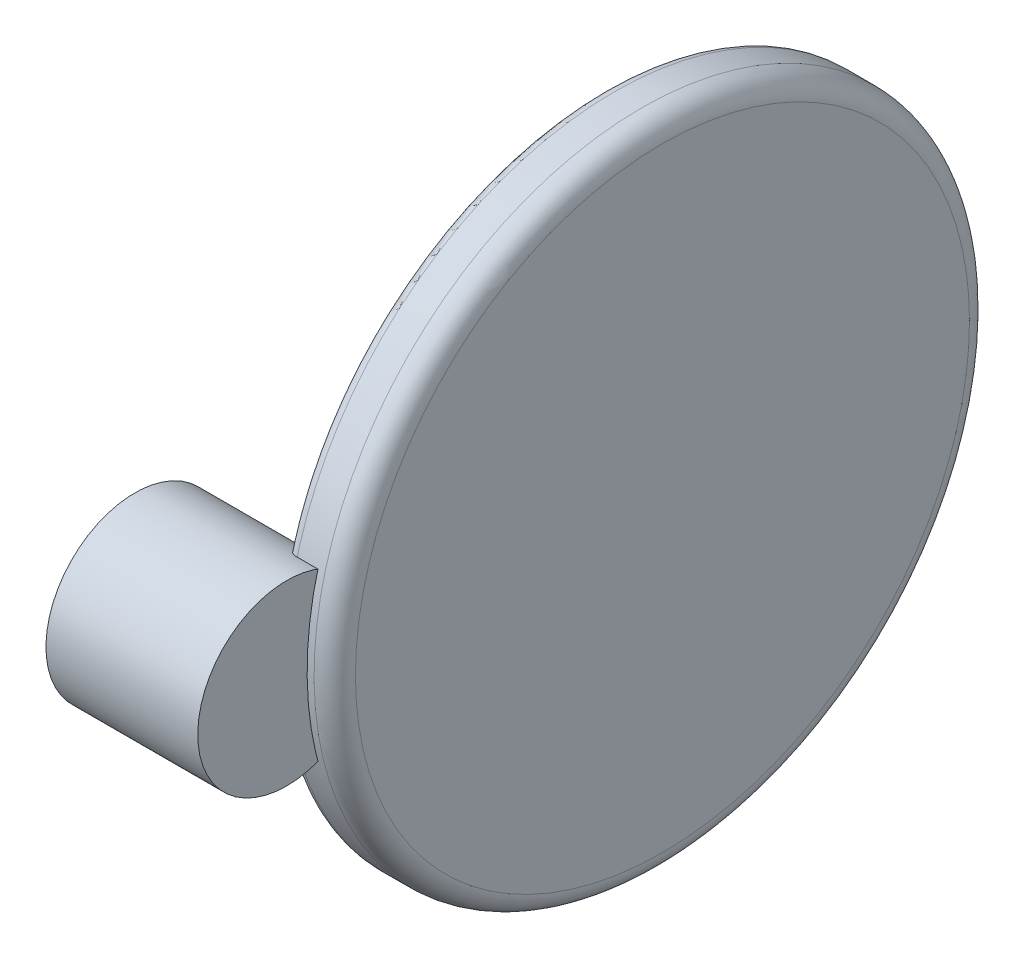
ISO-10303-21;
HEADER;
FILE_DESCRIPTION(('STEP AP214'),'2;1');
FILE_NAME('part.step','',(''),(''),'','','');
FILE_SCHEMA(('AUTOMOTIVE_DESIGN { 1 0 10303 214 1 1 1 1 }'));
ENDSEC;
DATA;
#1=APPLICATION_CONTEXT('core data for automotive mechanical design processes');
#2=APPLICATION_PROTOCOL_DEFINITION('international standard','automotive_design',2000,#1);
#3=PRODUCT_CONTEXT('',#1,'mechanical');
#4=PRODUCT('Part','Part','',(#3));
#5=PRODUCT_RELATED_PRODUCT_CATEGORY('part','',(#4));
#6=PRODUCT_DEFINITION_FORMATION('','',#4);
#7=PRODUCT_DEFINITION_CONTEXT('part definition',#1,'design');
#8=PRODUCT_DEFINITION('design','',#6,#7);
#9=PRODUCT_DEFINITION_SHAPE('','',#8);
#10=(LENGTH_UNIT() NAMED_UNIT(*) SI_UNIT(.MILLI.,.METRE.));
#11=(NAMED_UNIT(*) PLANE_ANGLE_UNIT() SI_UNIT($,.RADIAN.));
#12=(NAMED_UNIT(*) SI_UNIT($,.STERADIAN.) SOLID_ANGLE_UNIT());
#13=UNCERTAINTY_MEASURE_WITH_UNIT(LENGTH_MEASURE(1.E-05),#10,'distance_accuracy_value','');
#14=(GEOMETRIC_REPRESENTATION_CONTEXT(3) GLOBAL_UNCERTAINTY_ASSIGNED_CONTEXT((#13)) GLOBAL_UNIT_ASSIGNED_CONTEXT((#10,
#11,#12)) REPRESENTATION_CONTEXT('',''));
#15=CARTESIAN_POINT('',(0.,0.,0.));
#16=DIRECTION('',(0.,0.,1.));
#17=DIRECTION('',(1.,0.,0.));
#18=AXIS2_PLACEMENT_3D('',#15,#16,#17);
#19=CARTESIAN_POINT('',(8.255,0.,50.4527690620356));
#20=DIRECTION('',(1.,0.,0.));
#21=DIRECTION('',(0.,1.,0.));
#22=AXIS2_PLACEMENT_3D('',#19,#20,#21);
#23=PLANE('',#22);
#24=CARTESIAN_POINT('',(8.255,0.,50.4527690620356));
#25=DIRECTION('',(-1.,0.,0.));
#26=DIRECTION('',(0.,-1.,0.));
#27=AXIS2_PLACEMENT_3D('',#24,#25,#26);
#28=CIRCLE('',#27,3.71375);
#29=CARTESIAN_POINT('',(8.255,-3.71375,50.4527690620356));
#30=VERTEX_POINT('',#29);
#31=EDGE_CURVE('E61',#30,#30,#28,.T.);
#32=ORIENTED_EDGE('',*,*,#31,.F.);
#33=EDGE_LOOP('',(#32));
#34=FACE_BOUND('',#33,.T.);
#35=CARTESIAN_POINT('',(8.255,0.,50.4527690620356));
#36=DIRECTION('',(-1.,0.,0.));
#37=DIRECTION('',(0.,-1.,0.));
#38=AXIS2_PLACEMENT_3D('',#35,#36,#37);
#39=CIRCLE('',#38,12.9);
#40=CARTESIAN_POINT('',(8.255,-12.9,50.4527690620356));
#41=VERTEX_POINT('',#40);
#42=EDGE_CURVE('E11',#41,#41,#39,.T.);
#43=ORIENTED_EDGE('',*,*,#42,.T.);
#44=EDGE_LOOP('',(#43));
#45=FACE_BOUND('',#44,.T.);
#46=ADVANCED_FACE('F47',(#34,#45),#23,.F.);
#47=CARTESIAN_POINT('',(8.255,0.,50.4527690620356));
#48=DIRECTION('',(-1.,0.,0.));
#49=DIRECTION('',(0.,-1.,0.));
#50=AXIS2_PLACEMENT_3D('',#47,#48,#49);
#51=CYLINDRICAL_SURFACE('',#50,12.9);
#52=ORIENTED_EDGE('',*,*,#42,.F.);
#53=EDGE_LOOP('',(#52));
#54=FACE_BOUND('',#53,.T.);
#55=CARTESIAN_POINT('',(30.255,0.,50.4527690620356));
#56=DIRECTION('',(-1.,0.,0.));
#57=DIRECTION('',(0.,-1.,0.));
#58=AXIS2_PLACEMENT_3D('',#55,#56,#57);
#59=CIRCLE('',#58,12.9);
#60=CARTESIAN_POINT('',(30.255,-12.9,50.4527690620356));
#61=VERTEX_POINT('',#60);
#62=EDGE_CURVE('E53',#61,#61,#59,.T.);
#63=ORIENTED_EDGE('',*,*,#62,.T.);
#64=EDGE_LOOP('',(#63));
#65=FACE_BOUND('',#64,.T.);
#66=ADVANCED_FACE('F70',(#54,#65),#51,.T.);
#67=CARTESIAN_POINT('',(30.255,12.9,50.4527690620356));
#68=DIRECTION('',(-1.,0.,0.));
#69=DIRECTION('',(0.,-1.,0.));
#70=AXIS2_PLACEMENT_3D('',#67,#68,#69);
#71=PLANE('',#70);
#72=ORIENTED_EDGE('',*,*,#62,.F.);
#73=EDGE_LOOP('',(#72));
#74=FACE_BOUND('',#73,.T.);
#75=ADVANCED_FACE('F74',(#74),#71,.F.);
#76=CARTESIAN_POINT('',(15.8275,0.,50.4527690620356));
#77=DIRECTION('',(-1.,0.,0.));
#78=DIRECTION('',(0.,-1.,0.));
#79=AXIS2_PLACEMENT_3D('',#76,#77,#78);
#80=CYLINDRICAL_SURFACE('',#79,3.71375);
#81=CARTESIAN_POINT('',(15.8275,0.,50.4527690620356));
#82=DIRECTION('',(-1.,0.,0.));
#83=DIRECTION('',(0.,-1.,0.));
#84=AXIS2_PLACEMENT_3D('',#81,#82,#83);
#85=CIRCLE('',#84,3.71375);
#86=CARTESIAN_POINT('',(15.8275,-3.71375,50.4527690620356));
#87=VERTEX_POINT('',#86);
#88=EDGE_CURVE('E57',#87,#87,#85,.T.);
#89=ORIENTED_EDGE('',*,*,#88,.F.);
#90=EDGE_LOOP('',(#89));
#91=FACE_BOUND('',#90,.T.);
#92=ORIENTED_EDGE('',*,*,#31,.T.);
#93=EDGE_LOOP('',(#92));
#94=FACE_BOUND('',#93,.T.);
#95=ADVANCED_FACE('F67',(#91,#94),#80,.F.);
#96=CARTESIAN_POINT('',(15.8275,0.,50.4527690620356));
#97=DIRECTION('',(-1.,0.,0.));
#98=DIRECTION('',(0.,-1.,0.));
#99=AXIS2_PLACEMENT_3D('',#96,#97,#98);
#100=PLANE('',#99);
#101=ORIENTED_EDGE('',*,*,#88,.T.);
#102=EDGE_LOOP('',(#101));
#103=FACE_BOUND('',#102,.T.);
#104=ADVANCED_FACE('F84',(#103),#100,.T.);
#105=CLOSED_SHELL('',(#46,#66,#75,#95,#104));
#106=MANIFOLD_SOLID_BREP('B2_NOT_SHOWN',#105);
#107=CARTESIAN_POINT('',(8.255,0.,0.));
#108=DIRECTION('',(1.,0.,0.));
#109=DIRECTION('',(0.,1.,0.));
#110=AXIS2_PLACEMENT_3D('',#107,#108,#109);
#111=PLANE('',#110);
#112=CARTESIAN_POINT('',(8.255,0.,0.));
#113=DIRECTION('',(-1.,0.,0.));
#114=DIRECTION('',(0.,-1.,0.));
#115=AXIS2_PLACEMENT_3D('',#112,#113,#114);
#116=CIRCLE('',#115,3.71375);
#117=CARTESIAN_POINT('',(8.255,-3.71375,0.));
#118=VERTEX_POINT('',#117);
#119=EDGE_CURVE('E147',#118,#118,#116,.T.);
#120=ORIENTED_EDGE('',*,*,#119,.F.);
#121=EDGE_LOOP('',(#120));
#122=FACE_BOUND('',#121,.T.);
#123=CARTESIAN_POINT('',(8.255,0.,0.));
#124=DIRECTION('',(-1.,0.,0.));
#125=DIRECTION('',(0.,-1.,0.));
#126=AXIS2_PLACEMENT_3D('',#123,#124,#125);
#127=CIRCLE('',#126,12.9);
#128=CARTESIAN_POINT('',(8.255,-12.9,0.));
#129=VERTEX_POINT('',#128);
#130=EDGE_CURVE('E142',#129,#129,#127,.T.);
#131=ORIENTED_EDGE('',*,*,#130,.T.);
#132=EDGE_LOOP('',(#131));
#133=FACE_BOUND('',#132,.T.);
#134=ADVANCED_FACE('F118',(#122,#133),#111,.F.);
#135=CARTESIAN_POINT('',(8.255,0.,0.));
#136=DIRECTION('',(-1.,0.,0.));
#137=DIRECTION('',(0.,-1.,0.));
#138=AXIS2_PLACEMENT_3D('',#135,#136,#137);
#139=CYLINDRICAL_SURFACE('',#138,12.9);
#140=CARTESIAN_POINT('',(25.755,0.,0.));
#141=DIRECTION('',(-1.,0.,0.));
#142=DIRECTION('',(0.,-1.,0.));
#143=AXIS2_PLACEMENT_3D('',#140,#141,#142);
#144=CIRCLE('',#143,12.9);
#145=CARTESIAN_POINT('',(25.755,-12.9,0.));
#146=VERTEX_POINT('',#145);
#147=EDGE_CURVE('E143',#146,#146,#144,.T.);
#148=ORIENTED_EDGE('',*,*,#147,.T.);
#149=EDGE_LOOP('',(#148));
#150=FACE_BOUND('',#149,.T.);
#151=ORIENTED_EDGE('',*,*,#130,.F.);
#152=EDGE_LOOP('',(#151));
#153=FACE_BOUND('',#152,.T.);
#154=ADVANCED_FACE('F164',(#150,#153),#139,.T.);
#155=CARTESIAN_POINT('',(15.8275,0.,0.));
#156=DIRECTION('',(-1.,0.,0.));
#157=DIRECTION('',(0.,-1.,0.));
#158=AXIS2_PLACEMENT_3D('',#155,#156,#157);
#159=CYLINDRICAL_SURFACE('',#158,3.71375);
#160=CARTESIAN_POINT('',(15.8275,0.,0.));
#161=DIRECTION('',(-1.,0.,0.));
#162=DIRECTION('',(0.,-1.,0.));
#163=AXIS2_PLACEMENT_3D('',#160,#161,#162);
#164=CIRCLE('',#163,3.71375);
#165=CARTESIAN_POINT('',(15.8275,-3.71375,0.));
#166=VERTEX_POINT('',#165);
#167=EDGE_CURVE('E151',#166,#166,#164,.T.);
#168=ORIENTED_EDGE('',*,*,#167,.F.);
#169=EDGE_LOOP('',(#168));
#170=FACE_BOUND('',#169,.T.);
#171=ORIENTED_EDGE('',*,*,#119,.T.);
#172=EDGE_LOOP('',(#171));
#173=FACE_BOUND('',#172,.T.);
#174=ADVANCED_FACE('F161',(#170,#173),#159,.F.);
#175=CARTESIAN_POINT('',(15.8275,0.,0.));
#176=DIRECTION('',(-1.,0.,0.));
#177=DIRECTION('',(0.,-1.,0.));
#178=AXIS2_PLACEMENT_3D('',#175,#176,#177);
#179=PLANE('',#178);
#180=ORIENTED_EDGE('',*,*,#167,.T.);
#181=EDGE_LOOP('',(#180));
#182=FACE_BOUND('',#181,.T.);
#183=ADVANCED_FACE('F159',(#182),#179,.T.);
#184=CARTESIAN_POINT('',(34.255,0.,0.));
#185=DIRECTION('',(1.,0.,0.));
#186=DIRECTION('',(0.,1.,0.));
#187=AXIS2_PLACEMENT_3D('',#184,#185,#186);
#188=PLANE('',#187);
#189=CARTESIAN_POINT('',(34.255,0.,0.));
#190=DIRECTION('',(1.,0.,0.));
#191=DIRECTION('',(0.,1.,0.));
#192=AXIS2_PLACEMENT_3D('',#189,#190,#191);
#193=CIRCLE('',#192,44.5);
#194=CARTESIAN_POINT('',(34.255,44.5,0.));
#195=VERTEX_POINT('',#194);
#196=EDGE_CURVE('E136',#195,#195,#193,.T.);
#197=ORIENTED_EDGE('',*,*,#196,.T.);
#198=EDGE_LOOP('',(#197));
#199=FACE_BOUND('',#198,.T.);
#200=ADVANCED_FACE('F194',(#199),#188,.T.);
#201=CARTESIAN_POINT('',(34.255,0.,0.));
#202=DIRECTION('',(1.,0.,0.));
#203=DIRECTION('',(0.,1.,0.));
#204=AXIS2_PLACEMENT_3D('',#201,#202,#203);
#205=CYLINDRICAL_SURFACE('',#204,47.5);
#206=CARTESIAN_POINT('',(27.255,0.,0.));
#207=DIRECTION('',(-1.,0.,0.));
#208=DIRECTION('',(0.,-1.,0.));
#209=AXIS2_PLACEMENT_3D('',#206,#207,#208);
#210=CIRCLE('',#209,47.5);
#211=CARTESIAN_POINT('',(27.255,-47.5,0.));
#212=VERTEX_POINT('',#211);
#213=EDGE_CURVE('E126',#212,#212,#210,.F.);
#214=ORIENTED_EDGE('',*,*,#213,.T.);
#215=EDGE_LOOP('',(#214));
#216=FACE_BOUND('',#215,.T.);
#217=CARTESIAN_POINT('',(31.255,0.,0.));
#218=DIRECTION('',(1.,0.,0.));
#219=DIRECTION('',(0.,1.,0.));
#220=AXIS2_PLACEMENT_3D('',#217,#218,#219);
#221=CIRCLE('',#220,47.5);
#222=CARTESIAN_POINT('',(31.255,47.5,0.));
#223=VERTEX_POINT('',#222);
#224=EDGE_CURVE('E131',#223,#223,#221,.F.);
#225=ORIENTED_EDGE('',*,*,#224,.T.);
#226=EDGE_LOOP('',(#225));
#227=FACE_BOUND('',#226,.T.);
#228=ADVANCED_FACE('F188',(#216,#227),#205,.T.);
#229=CARTESIAN_POINT('',(25.755,47.5,0.));
#230=DIRECTION('',(-1.,0.,0.));
#231=DIRECTION('',(0.,-1.,0.));
#232=AXIS2_PLACEMENT_3D('',#229,#230,#231);
#233=PLANE('',#232);
#234=CARTESIAN_POINT('',(25.755,0.,0.));
#235=DIRECTION('',(-1.,0.,0.));
#236=DIRECTION('',(0.,-1.,0.));
#237=AXIS2_PLACEMENT_3D('',#234,#235,#236);
#238=CIRCLE('',#237,46.);
#239=CARTESIAN_POINT('',(25.755,-46.,0.));
#240=VERTEX_POINT('',#239);
#241=EDGE_CURVE('E46',#240,#240,#238,.T.);
#242=ORIENTED_EDGE('',*,*,#241,.T.);
#243=EDGE_LOOP('',(#242));
#244=FACE_BOUND('',#243,.T.);
#245=ORIENTED_EDGE('',*,*,#147,.F.);
#246=EDGE_LOOP('',(#245));
#247=FACE_BOUND('',#246,.T.);
#248=ADVANCED_FACE('F181',(#244,#247),#233,.T.);
#249=CARTESIAN_POINT('',(31.255,0.,0.));
#250=DIRECTION('',(1.,0.,0.));
#251=DIRECTION('',(0.,1.,0.));
#252=AXIS2_PLACEMENT_3D('',#249,#250,#251);
#253=TOROIDAL_SURFACE('',#252,44.5,3.);
#254=ORIENTED_EDGE('',*,*,#224,.F.);
#255=EDGE_LOOP('',(#254));
#256=FACE_BOUND('',#255,.T.);
#257=ORIENTED_EDGE('',*,*,#196,.F.);
#258=EDGE_LOOP('',(#257));
#259=FACE_BOUND('',#258,.T.);
#260=ADVANCED_FACE('F179',(#256,#259),#253,.T.);
#261=CARTESIAN_POINT('',(27.255,0.,0.));
#262=DIRECTION('',(-1.,0.,0.));
#263=DIRECTION('',(0.,-1.,0.));
#264=AXIS2_PLACEMENT_3D('',#261,#262,#263);
#265=TOROIDAL_SURFACE('',#264,46.,1.5);
#266=ORIENTED_EDGE('',*,*,#241,.F.);
#267=EDGE_LOOP('',(#266));
#268=FACE_BOUND('',#267,.T.);
#269=ORIENTED_EDGE('',*,*,#213,.F.);
#270=EDGE_LOOP('',(#269));
#271=FACE_BOUND('',#270,.T.);
#272=ADVANCED_FACE('F120',(#268,#271),#265,.T.);
#273=CLOSED_SHELL('',(#134,#154,#174,#183,#200,#228,#248,#260,#272));
#274=MANIFOLD_SOLID_BREP('B6',#273);
#275=ADVANCED_BREP_SHAPE_REPRESENTATION('',(#18,#106,#274),#14);
#276=SHAPE_DEFINITION_REPRESENTATION(#9,#275);
ENDSEC;
END-ISO-10303-21;
